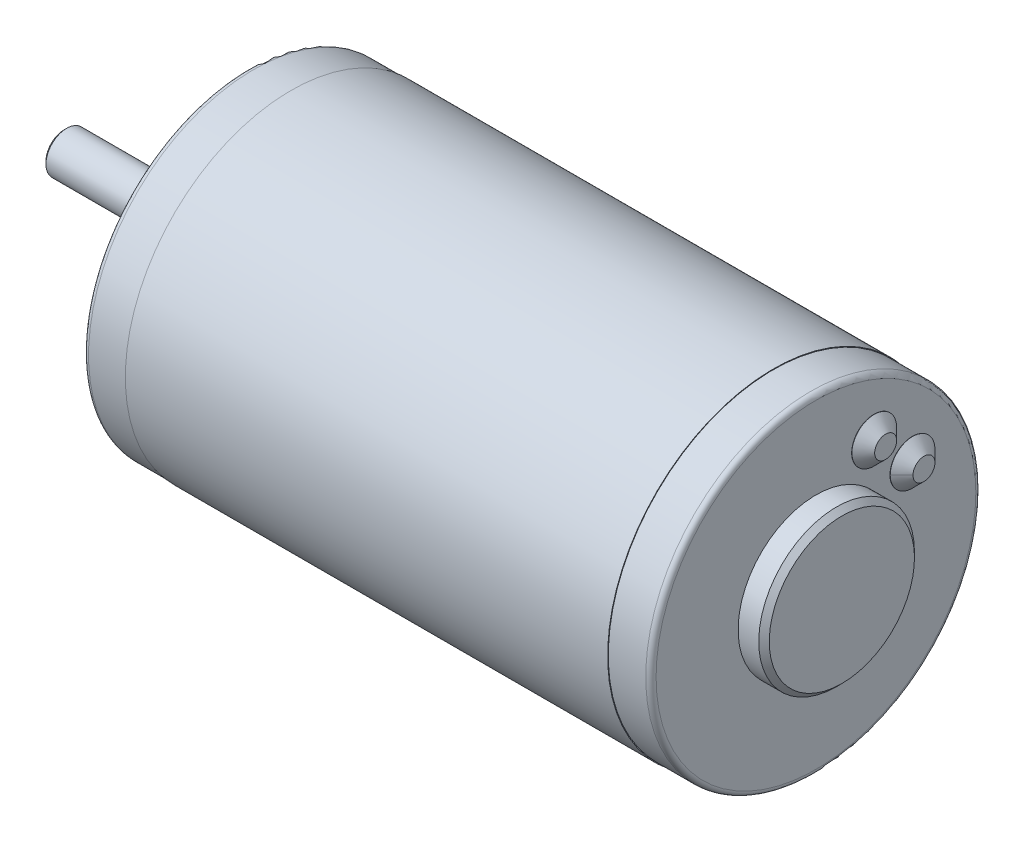
ISO-10303-21;
HEADER;
FILE_DESCRIPTION(('STEP AP214'),'2;1');
FILE_NAME('part.step','',(''),(''),'','','');
FILE_SCHEMA(('AUTOMOTIVE_DESIGN { 1 0 10303 214 1 1 1 1 }'));
ENDSEC;
DATA;
#1=APPLICATION_CONTEXT('core data for automotive mechanical design processes');
#2=APPLICATION_PROTOCOL_DEFINITION('international standard','automotive_design',2000,#1);
#3=PRODUCT_CONTEXT('',#1,'mechanical');
#4=PRODUCT('Part','Part','',(#3));
#5=PRODUCT_RELATED_PRODUCT_CATEGORY('part','',(#4));
#6=PRODUCT_DEFINITION_FORMATION('','',#4);
#7=PRODUCT_DEFINITION_CONTEXT('part definition',#1,'design');
#8=PRODUCT_DEFINITION('design','',#6,#7);
#9=PRODUCT_DEFINITION_SHAPE('','',#8);
#10=(LENGTH_UNIT() NAMED_UNIT(*) SI_UNIT(.MILLI.,.METRE.));
#11=(NAMED_UNIT(*) PLANE_ANGLE_UNIT() SI_UNIT($,.RADIAN.));
#12=(NAMED_UNIT(*) SI_UNIT($,.STERADIAN.) SOLID_ANGLE_UNIT());
#13=UNCERTAINTY_MEASURE_WITH_UNIT(LENGTH_MEASURE(1.E-05),#10,'distance_accuracy_value','');
#14=(GEOMETRIC_REPRESENTATION_CONTEXT(3) GLOBAL_UNCERTAINTY_ASSIGNED_CONTEXT((#13)) GLOBAL_UNIT_ASSIGNED_CONTEXT((#10,
#11,#12)) REPRESENTATION_CONTEXT('',''));
#15=CARTESIAN_POINT('',(0.,0.,0.));
#16=DIRECTION('',(0.,0.,1.));
#17=DIRECTION('',(1.,0.,0.));
#18=AXIS2_PLACEMENT_3D('',#15,#16,#17);
#19=CARTESIAN_POINT('',(-35.6,0.,0.));
#20=DIRECTION('',(-1.,0.,0.));
#21=DIRECTION('',(0.,0.,1.));
#22=AXIS2_PLACEMENT_3D('',#19,#20,#21);
#23=PLANE('',#22);
#24=CARTESIAN_POINT('',(-35.5999999999881,0.,0.));
#25=DIRECTION('',(1.,0.,0.));
#26=DIRECTION('',(0.,0.,-1.));
#27=AXIS2_PLACEMENT_3D('',#24,#25,#26);
#28=CIRCLE('',#27,3.50000000003092);
#29=CARTESIAN_POINT('',(-35.5999999999881,0.,-3.50000000003092));
#30=VERTEX_POINT('',#29);
#31=EDGE_CURVE('E113',#30,#30,#28,.T.);
#32=ORIENTED_EDGE('',*,*,#31,.F.);
#33=EDGE_LOOP('',(#32));
#34=FACE_BOUND('',#33,.T.);
#35=ADVANCED_FACE('F17',(#34),#23,.T.);
#36=CARTESIAN_POINT('',(-27.6,-1.,-2.8));
#37=DIRECTION('',(0.,0.,1.));
#38=DIRECTION('',(1.,0.,0.));
#39=AXIS2_PLACEMENT_3D('',#36,#37,#38);
#40=PLANE('',#39);
#41=CARTESIAN_POINT('',(-7.1,0.,-2.8));
#42=DIRECTION('',(0.,0.,-1.));
#43=DIRECTION('',(-1.,0.,0.));
#44=AXIS2_PLACEMENT_3D('',#41,#42,#43);
#45=CIRCLE('',#44,1.);
#46=CARTESIAN_POINT('',(-7.1,1.,-2.799999999665));
#47=VERTEX_POINT('',#46);
#48=CARTESIAN_POINT('',(-7.1,-1.,-2.799999999665));
#49=VERTEX_POINT('',#48);
#50=EDGE_CURVE('E90',#47,#49,#45,.T.);
#51=ORIENTED_EDGE('',*,*,#50,.T.);
#52=DIRECTION('',(1.,0.,0.));
#53=VECTOR('',#52,1.);
#54=CARTESIAN_POINT('',(-27.6,-1.,-2.79999999933));
#55=LINE('',#54,#53);
#56=CARTESIAN_POINT('',(-26.6,-1.,-2.79999999933));
#57=VERTEX_POINT('',#56);
#58=EDGE_CURVE('E117',#57,#49,#55,.T.);
#59=ORIENTED_EDGE('',*,*,#58,.F.);
#60=CARTESIAN_POINT('',(-26.6,0.,-2.79999999933));
#61=DIRECTION('',(0.,0.,1.));
#62=DIRECTION('',(1.,0.,0.));
#63=AXIS2_PLACEMENT_3D('',#60,#61,#62);
#64=CIRCLE('',#63,1.);
#65=CARTESIAN_POINT('',(-26.6,1.,-2.799999999665));
#66=VERTEX_POINT('',#65);
#67=EDGE_CURVE('E93',#57,#66,#64,.F.);
#68=ORIENTED_EDGE('',*,*,#67,.T.);
#69=DIRECTION('',(1.,0.,0.));
#70=VECTOR('',#69,1.);
#71=CARTESIAN_POINT('',(-27.6,1.,-2.79999999933));
#72=LINE('',#71,#70);
#73=EDGE_CURVE('E87',#66,#47,#72,.T.);
#74=ORIENTED_EDGE('',*,*,#73,.T.);
#75=EDGE_LOOP('',(#51,#59,#68,#74));
#76=FACE_BOUND('',#75,.T.);
#77=ADVANCED_FACE('F89',(#76),#40,.F.);
#78=CARTESIAN_POINT('',(-27.6,1.,-2.8));
#79=DIRECTION('',(0.,1.,0.));
#80=DIRECTION('',(0.,0.,1.));
#81=AXIS2_PLACEMENT_3D('',#78,#79,#80);
#82=PLANE('',#81);
#83=DIRECTION('',(0.,0.,1.));
#84=VECTOR('',#83,1.);
#85=CARTESIAN_POINT('',(-7.1,1.,-2.8));
#86=LINE('',#85,#84);
#87=CARTESIAN_POINT('',(-7.1,0.999999999999687,-3.8729833462075));
#88=VERTEX_POINT('',#87);
#89=EDGE_CURVE('E98',#47,#88,#86,.F.);
#90=ORIENTED_EDGE('',*,*,#89,.F.);
#91=ORIENTED_EDGE('',*,*,#73,.F.);
#92=DIRECTION('',(0.,0.,1.));
#93=VECTOR('',#92,1.);
#94=CARTESIAN_POINT('',(-26.6,1.,-3.87298334621));
#95=LINE('',#94,#93);
#96=CARTESIAN_POINT('',(-26.5999999998,0.999999999999844,-3.8729833462075));
#97=VERTEX_POINT('',#96);
#98=EDGE_CURVE('E111',#66,#97,#95,.F.);
#99=ORIENTED_EDGE('',*,*,#98,.T.);
#100=DIRECTION('',(1.,0.,0.));
#101=VECTOR('',#100,1.);
#102=CARTESIAN_POINT('',(0.,0.999999999999375,-3.87298334620758));
#103=LINE('',#102,#101);
#104=EDGE_CURVE('E110',#88,#97,#103,.F.);
#105=ORIENTED_EDGE('',*,*,#104,.F.);
#106=EDGE_LOOP('',(#90,#91,#99,#105));
#107=FACE_BOUND('',#106,.T.);
#108=ADVANCED_FACE('F108',(#107),#82,.F.);
#109=CARTESIAN_POINT('',(-35.1000000000568,0.,0.));
#110=DIRECTION('',(1.,0.,0.));
#111=DIRECTION('',(0.,0.,-1.));
#112=AXIS2_PLACEMENT_3D('',#109,#110,#111);
#113=CONICAL_SURFACE('',#112,3.99999999996226,0.785398163397448);
#114=ORIENTED_EDGE('',*,*,#31,.T.);
#115=EDGE_LOOP('',(#114));
#116=FACE_BOUND('',#115,.T.);
#117=CARTESIAN_POINT('',(-35.1,0.,0.));
#118=DIRECTION('',(1.,0.,0.));
#119=DIRECTION('',(0.,0.,-1.));
#120=AXIS2_PLACEMENT_3D('',#117,#118,#119);
#121=CIRCLE('',#120,4.);
#122=CARTESIAN_POINT('',(-35.1,0.,-4.));
#123=VERTEX_POINT('',#122);
#124=EDGE_CURVE('E621',#123,#123,#121,.T.);
#125=ORIENTED_EDGE('',*,*,#124,.F.);
#126=EDGE_LOOP('',(#125));
#127=FACE_BOUND('',#126,.T.);
#128=ADVANCED_FACE('F544',(#116,#127),#113,.T.);
#129=CARTESIAN_POINT('',(-26.6,0.,-3.87298334621));
#130=DIRECTION('',(0.,0.,1.));
#131=DIRECTION('',(1.,0.,0.));
#132=AXIS2_PLACEMENT_3D('',#129,#130,#131);
#133=CYLINDRICAL_SURFACE('',#132,1.);
#134=DIRECTION('',(0.,0.,1.));
#135=VECTOR('',#134,1.);
#136=CARTESIAN_POINT('',(-26.6,-1.,-2.8));
#137=LINE('',#136,#135);
#138=CARTESIAN_POINT('',(-26.6,-0.999999999999688,-3.8729833462075));
#139=VERTEX_POINT('',#138);
#140=EDGE_CURVE('E118',#139,#57,#137,.T.);
#141=ORIENTED_EDGE('',*,*,#140,.F.);
#142=CARTESIAN_POINT('',(-26.5999999996,1.,-3.87298334620742));
#143=CARTESIAN_POINT('',(-26.6276629614854,1.00000033684389,-3.87298148578343));
#144=CARTESIAN_POINT('',(-26.6553122162158,0.998851408995708,-3.87328009897941));
#145=CARTESIAN_POINT('',(-26.7104039428575,0.994271305353044,-3.87445904528256));
#146=CARTESIAN_POINT('',(-26.7378464487771,0.990840513576567,-3.8753392805076));
#147=CARTESIAN_POINT('',(-26.8194530829467,0.977175260932386,-3.87881710391479));
#148=CARTESIAN_POINT('',(-26.8730564242201,0.963567703796365,-3.88225202754239));
#149=CARTESIAN_POINT('',(-26.9771255932072,0.927797766818545,-3.89095430300691));
#150=CARTESIAN_POINT('',(-27.0275916625837,0.905636046850779,-3.89622151349687));
#151=CARTESIAN_POINT('',(-27.1241130860774,0.853414285295463,-3.90799157482));
#152=CARTESIAN_POINT('',(-27.170167409718,0.823352404530651,-3.91449471328259));
#153=CARTESIAN_POINT('',(-27.2575394861224,0.755487979522312,-3.92816193939745));
#154=CARTESIAN_POINT('',(-27.2987466449772,0.717545201761585,-3.93533648743472));
#155=CARTESIAN_POINT('',(-27.3742952873619,0.63528422785457,-3.94944965641121));
#156=CARTESIAN_POINT('',(-27.4086343064925,0.590963753060668,-3.95638819192684));
#157=CARTESIAN_POINT('',(-27.4699263911241,0.496434353634745,-3.96936513276029));
#158=CARTESIAN_POINT('',(-27.4967663592451,0.446150035504182,-3.97538918744967));
#159=CARTESIAN_POINT('',(-27.5415435233383,0.341642316787624,-3.98572777187027));
#160=CARTESIAN_POINT('',(-27.5594913900092,0.287423727463188,-3.99004434934737));
#161=CARTESIAN_POINT('',(-27.5817561326448,0.19411173597787,-3.99546891718622));
#162=CARTESIAN_POINT('',(-27.588585793313,0.155632918302861,-3.99715927897636));
#163=CARTESIAN_POINT('',(-27.5977085408051,0.0781080029209764,-3.99942531582434));
#164=CARTESIAN_POINT('',(-27.6000016937716,0.0390619134933367,-4.00000100713419));
#165=CARTESIAN_POINT('',(-27.599997605085,-0.0552317459835864,-3.99999857595865));
#166=CARTESIAN_POINT('',(-27.5954072017814,-0.110495128479081,-3.99884417849431));
#167=CARTESIAN_POINT('',(-27.5771887284743,-0.219452299234612,-3.99434884496972));
#168=CARTESIAN_POINT('',(-27.5635520456882,-0.273144540728357,-3.99100582520555));
#169=CARTESIAN_POINT('',(-27.5277065776784,-0.377348216031181,-3.98250401525139));
#170=CARTESIAN_POINT('',(-27.50550949133,-0.427863881926113,-3.97734770399773));
#171=CARTESIAN_POINT('',(-27.4532106110737,-0.524450982676832,-3.9657685861392));
#172=CARTESIAN_POINT('',(-27.423109018223,-0.570522530531401,-3.9593458117488));
#173=CARTESIAN_POINT('',(-27.3552003629654,-0.657866871057278,-3.94578291730052));
#174=CARTESIAN_POINT('',(-27.3172610821916,-0.699035148909374,-3.93863172676562));
#175=CARTESIAN_POINT('',(-27.2350335448416,-0.774497762760061,-3.92449111086287));
#176=CARTESIAN_POINT('',(-27.19074427933,-0.808791004318425,-3.917501711407));
#177=CARTESIAN_POINT('',(-27.0962571540367,-0.870026617564648,-3.90436326544461));
#178=CARTESIAN_POINT('',(-27.0459800204073,-0.896849892050556,-3.89822853701072));
#179=CARTESIAN_POINT('',(-26.9414633719415,-0.941609493202648,-3.88766043493568));
#180=CARTESIAN_POINT('',(-26.8872268673446,-0.959552492279161,-3.88322578446617));
#181=CARTESIAN_POINT('',(-26.7939162001483,-0.98179305738855,-3.87765011739136));
#182=CARTESIAN_POINT('',(-26.7554596460299,-0.988610024876976,-3.87591131774124));
#183=CARTESIAN_POINT('',(-26.6780089785749,-0.997716332082783,-3.87357302813837));
#184=CARTESIAN_POINT('',(-26.6390152728012,-1.00000893261029,-3.87297271766376));
#185=CARTESIAN_POINT('',(-26.6,-1.,-3.87298334620742));
#186=B_SPLINE_CURVE_WITH_KNOTS('',3,(#142,#143,#144,#145,#146,#147,#148,#149,#150,#151,#152,
#153,#154,#155,#156,#157,#158,#159,#160,#161,#162,#163,#164,#165,#166,#167,#168,#169,#170,#171,
#172,#173,#174,#175,#176,#177,#178,#179,#180,#181,#182,#183,#184,#185),.UNSPECIFIED.,.F.,.F.,(4,
2,2,2,2,2,2,2,2,2,2,2,2,2,2,2,2,2,2,2,2,4),(0.,0.0829364608173561,0.165858967674383,
0.331229962700471,0.496588203442382,0.66198497415249,0.830625162069847,0.999325752680869,
1.17044795786402,1.34136431258294,1.45844938998505,1.57553276026342,1.74108325146555,
1.90679158664071,2.07227425833913,2.23775272126715,2.40629176885183,2.57485762497872,
2.74597444993972,2.91696250618347,3.03398040716278,3.15091393993875),.UNSPECIFIED.);
#187=EDGE_CURVE('E178',#97,#139,#186,.T.);
#188=ORIENTED_EDGE('',*,*,#187,.F.);
#189=ORIENTED_EDGE('',*,*,#98,.F.);
#190=ORIENTED_EDGE('',*,*,#67,.F.);
#191=EDGE_LOOP('',(#141,#188,#189,#190));
#192=FACE_BOUND('',#191,.T.);
#193=ADVANCED_FACE('F536',(#192),#133,.F.);
#194=CARTESIAN_POINT('',(-27.6,-1.,-2.8));
#195=DIRECTION('',(0.,1.,0.));
#196=DIRECTION('',(0.,0.,1.));
#197=AXIS2_PLACEMENT_3D('',#194,#195,#196);
#198=PLANE('',#197);
#199=DIRECTION('',(1.,0.,0.));
#200=VECTOR('',#199,1.);
#201=CARTESIAN_POINT('',(0.,-0.999999999999375,-3.87298334620758));
#202=LINE('',#201,#200);
#203=CARTESIAN_POINT('',(-7.1,-0.999999999999844,-3.8729833462075));
#204=VERTEX_POINT('',#203);
#205=EDGE_CURVE('E177',#139,#204,#202,.T.);
#206=ORIENTED_EDGE('',*,*,#205,.F.);
#207=ORIENTED_EDGE('',*,*,#140,.T.);
#208=ORIENTED_EDGE('',*,*,#58,.T.);
#209=DIRECTION('',(0.,0.,-1.));
#210=VECTOR('',#209,1.);
#211=CARTESIAN_POINT('',(-7.1,-1.,-2.8));
#212=LINE('',#211,#210);
#213=EDGE_CURVE('E106',#49,#204,#212,.T.);
#214=ORIENTED_EDGE('',*,*,#213,.T.);
#215=EDGE_LOOP('',(#206,#207,#208,#214));
#216=FACE_BOUND('',#215,.T.);
#217=ADVANCED_FACE('F529',(#216),#198,.T.);
#218=CARTESIAN_POINT('',(-7.1,0.,-2.8));
#219=DIRECTION('',(0.,0.,-1.));
#220=DIRECTION('',(-1.,0.,0.));
#221=AXIS2_PLACEMENT_3D('',#218,#219,#220);
#222=CYLINDRICAL_SURFACE('',#221,1.);
#223=ORIENTED_EDGE('',*,*,#213,.F.);
#224=ORIENTED_EDGE('',*,*,#50,.F.);
#225=ORIENTED_EDGE('',*,*,#89,.T.);
#226=CARTESIAN_POINT('',(-7.1,-1.0000000001221,-3.872983346302));
#227=CARTESIAN_POINT('',(-7.07233703811739,-1.00000033687793,-3.87298148582111));
#228=CARTESIAN_POINT('',(-7.04468778338877,-0.998851408986146,-3.8732800989946));
#229=CARTESIAN_POINT('',(-6.98959605674884,-0.994271305296994,-3.87445904528425));
#230=CARTESIAN_POINT('',(-6.96215355082925,-0.990840513517515,-3.87533928051829));
#231=CARTESIAN_POINT('',(-6.88054691665886,-0.977175260852706,-3.87881710394372));
#232=CARTESIAN_POINT('',(-6.82694357538663,-0.963567703687489,-3.88225202757187));
#233=CARTESIAN_POINT('',(-6.72287440640773,-0.927797766659824,-3.89095430304254));
#234=CARTESIAN_POINT('',(-6.67240833703816,-0.905636046671756,-3.89622151353801));
#235=CARTESIAN_POINT('',(-6.57588691356292,-0.853414285075293,-3.90799157486883));
#236=CARTESIAN_POINT('',(-6.52983258993375,-0.823352404289781,-3.91449471333359));
#237=CARTESIAN_POINT('',(-6.44246051355568,-0.755487979242093,-3.92816193945135));
#238=CARTESIAN_POINT('',(-6.40125335471588,-0.717545201462774,-3.93533648748934));
#239=CARTESIAN_POINT('',(-6.32570471236362,-0.63528422752032,-3.94944965646521));
#240=CARTESIAN_POINT('',(-6.29136569325069,-0.590963752709505,-3.95638819197949));
#241=CARTESIAN_POINT('',(-6.23007360865886,-0.496434353254452,-3.969365132808));
#242=CARTESIAN_POINT('',(-6.20323364055975,-0.446150035111945,-3.97538918749381));
#243=CARTESIAN_POINT('',(-6.15845647651223,-0.341642316375673,-3.9857277719057));
#244=CARTESIAN_POINT('',(-6.14050860986507,-0.287423727043496,-3.99004434937767));
#245=CARTESIAN_POINT('',(-6.11824386728725,-0.194111735619457,-3.995468917203));
#246=CARTESIAN_POINT('',(-6.11141420664443,-0.155632918014258,-3.9971592789869));
#247=CARTESIAN_POINT('',(-6.10229145918635,-0.07810800277512,-3.9994253158265));
#248=CARTESIAN_POINT('',(-6.09999830622838,-0.0390619134204156,-4.00000100713419));
#249=CARTESIAN_POINT('',(-6.10000239491503,0.0552317459833975,-3.99999857595865));
#250=CARTESIAN_POINT('',(-6.10459279821858,0.110495128478849,-3.99884417849432));
#251=CARTESIAN_POINT('',(-6.12281127152564,0.21945229923443,-3.99434884496973));
#252=CARTESIAN_POINT('',(-6.13644795431172,0.273144540728263,-3.99100582520556));
#253=CARTESIAN_POINT('',(-6.17229342232156,0.377348216031197,-3.98250401525139));
#254=CARTESIAN_POINT('',(-6.19449050867004,0.427863881926156,-3.97734770399773));
#255=CARTESIAN_POINT('',(-6.24678938892637,0.524450982676873,-3.96576858613919));
#256=CARTESIAN_POINT('',(-6.27689098177704,0.570522530531419,-3.9593458117488));
#257=CARTESIAN_POINT('',(-6.34479963703463,0.657866871057261,-3.94578291730052));
#258=CARTESIAN_POINT('',(-6.38273891780834,0.699035148909346,-3.93863172676563));
#259=CARTESIAN_POINT('',(-6.46496645515835,0.774497762760038,-3.92449111086287));
#260=CARTESIAN_POINT('',(-6.50925572067001,0.808791004318414,-3.917501711407));
#261=CARTESIAN_POINT('',(-6.60374284596335,0.870026617564677,-3.9043632654446));
#262=CARTESIAN_POINT('',(-6.65401997959275,0.896849892050607,-3.89822853701071));
#263=CARTESIAN_POINT('',(-6.75853662805867,0.941609493202684,-3.88766043493567));
#264=CARTESIAN_POINT('',(-6.81277313265555,0.959552492279176,-3.88322578446618));
#265=CARTESIAN_POINT('',(-6.90608379980686,0.981793057377871,-3.87765011739403));
#266=CARTESIAN_POINT('',(-6.94454035387909,0.98861002486086,-3.87591131774534));
#267=CARTESIAN_POINT('',(-7.02199102124091,0.997716332066555,-3.87357302814256));
#268=CARTESIAN_POINT('',(-7.06098472696764,1.0000089325994,-3.87297271766662));
#269=CARTESIAN_POINT('',(-7.0999999997225,1.,-3.87298334620742));
#270=B_SPLINE_CURVE_WITH_KNOTS('',3,(#226,#227,#228,#229,#230,#231,#232,#233,#234,#235,#236,
#237,#238,#239,#240,#241,#242,#243,#244,#245,#246,#247,#248,#249,#250,#251,#252,#253,#254,#255,
#256,#257,#258,#259,#260,#261,#262,#263,#264,#265,#266,#267,#268,#269),.UNSPECIFIED.,.F.,.F.,(4,
2,2,2,2,2,2,2,2,2,2,2,2,2,2,2,2,2,2,2,2,4),(0.,0.0829364608167722,0.16585896767728,
0.331229962718466,0.496588203468748,0.661984974184169,0.830625162106715,0.999325752724678,
1.17044795790744,1.3413643126246,1.45844938980816,1.57553275986813,1.74108325106995,
1.90679158624542,2.07227425794391,2.23775272087186,2.40629176845648,2.57485762458343,
2.7459744495446,2.91696250578819,3.03398040662922,3.15091393926647),.UNSPECIFIED.);
#271=EDGE_CURVE('E170',#204,#88,#270,.T.);
#272=ORIENTED_EDGE('',*,*,#271,.F.);
#273=EDGE_LOOP('',(#223,#224,#225,#272));
#274=FACE_BOUND('',#273,.T.);
#275=ADVANCED_FACE('F103',(#274),#222,.F.);
#276=CARTESIAN_POINT('',(0.,0.,0.));
#277=DIRECTION('',(1.,0.,0.));
#278=DIRECTION('',(0.,0.,-1.));
#279=AXIS2_PLACEMENT_3D('',#276,#277,#278);
#280=CYLINDRICAL_SURFACE('',#279,4.);
#281=ORIENTED_EDGE('',*,*,#124,.T.);
#282=EDGE_LOOP('',(#281));
#283=FACE_BOUND('',#282,.T.);
#284=ORIENTED_EDGE('',*,*,#104,.T.);
#285=ORIENTED_EDGE('',*,*,#187,.T.);
#286=ORIENTED_EDGE('',*,*,#205,.T.);
#287=ORIENTED_EDGE('',*,*,#271,.T.);
#288=EDGE_LOOP('',(#284,#285,#286,#287));
#289=FACE_BOUND('',#288,.T.);
#290=CARTESIAN_POINT('',(-4.,0.,0.));
#291=DIRECTION('',(1.,0.,0.));
#292=DIRECTION('',(0.,0.,-1.));
#293=AXIS2_PLACEMENT_3D('',#290,#291,#292);
#294=CIRCLE('',#293,4.);
#295=CARTESIAN_POINT('',(-4.,0.,-4.));
#296=VERTEX_POINT('',#295);
#297=EDGE_CURVE('E167',#296,#296,#294,.T.);
#298=ORIENTED_EDGE('',*,*,#297,.F.);
#299=EDGE_LOOP('',(#298));
#300=FACE_BOUND('',#299,.T.);
#301=ADVANCED_FACE('F186',(#283,#289,#300),#280,.T.);
#302=CARTESIAN_POINT('',(-4.,4.,0.));
#303=DIRECTION('',(-1.,0.,0.));
#304=DIRECTION('',(0.,0.,1.));
#305=AXIS2_PLACEMENT_3D('',#302,#303,#304);
#306=PLANE('',#305);
#307=ORIENTED_EDGE('',*,*,#297,.T.);
#308=EDGE_LOOP('',(#307));
#309=FACE_BOUND('',#308,.T.);
#310=CARTESIAN_POINT('',(-4.00000000000046,0.,0.));
#311=DIRECTION('',(1.,0.,0.));
#312=DIRECTION('',(0.,1.,0.));
#313=AXIS2_PLACEMENT_3D('',#310,#311,#312);
#314=CIRCLE('',#313,8.50900000000046);
#315=CARTESIAN_POINT('',(-4.00000000000046,8.50900000000046,0.));
#316=VERTEX_POINT('',#315);
#317=EDGE_CURVE('E164',#316,#316,#314,.T.);
#318=ORIENTED_EDGE('',*,*,#317,.F.);
#319=EDGE_LOOP('',(#318));
#320=FACE_BOUND('',#319,.T.);
#321=ADVANCED_FACE('F190',(#309,#320),#306,.T.);
#322=CARTESIAN_POINT('',(111.8479,11.2073596391,-18.6070906829));
#323=DIRECTION('',(1.,0.,0.));
#324=DIRECTION('',(0.,0.,-1.));
#325=AXIS2_PLACEMENT_3D('',#322,#323,#324);
#326=PLANE('',#325);
#327=CARTESIAN_POINT('',(111.847899999987,11.2073596391,-18.6070906829));
#328=DIRECTION('',(-1.,0.,0.));
#329=DIRECTION('',(0.,-1.,0.));
#330=AXIS2_PLACEMENT_3D('',#327,#328,#329);
#331=CIRCLE('',#330,2.11800000000174);
#332=CARTESIAN_POINT('',(111.847899999987,11.2073596391,-20.7250906828988));
#333=VERTEX_POINT('',#332);
#334=CARTESIAN_POINT('',(111.847899999987,11.2073596391,-16.4890906829071));
#335=VERTEX_POINT('',#334);
#336=EDGE_CURVE('E161',#333,#335,#331,.T.);
#337=ORIENTED_EDGE('',*,*,#336,.F.);
#338=CARTESIAN_POINT('',(111.847899999987,11.2073596391,-18.6070906829));
#339=DIRECTION('',(-1.,0.,0.));
#340=DIRECTION('',(0.,0.,1.));
#341=AXIS2_PLACEMENT_3D('',#338,#339,#340);
#342=CIRCLE('',#341,2.11799999998995);
#343=EDGE_CURVE('E157',#335,#333,#342,.T.);
#344=ORIENTED_EDGE('',*,*,#343,.F.);
#345=EDGE_LOOP('',(#337,#344));
#346=FACE_BOUND('',#345,.T.);
#347=ADVANCED_FACE('F195',(#346),#326,.T.);
#348=CARTESIAN_POINT('',(111.8479,18.6070906829,-11.2073596391));
#349=DIRECTION('',(1.,0.,0.));
#350=DIRECTION('',(0.,0.,-1.));
#351=AXIS2_PLACEMENT_3D('',#348,#349,#350);
#352=PLANE('',#351);
#353=CARTESIAN_POINT('',(111.847899999987,18.6070906829,-11.2073596391));
#354=DIRECTION('',(-1.,0.,0.));
#355=DIRECTION('',(0.,0.,1.));
#356=AXIS2_PLACEMENT_3D('',#353,#354,#355);
#357=CIRCLE('',#356,2.11799999998028);
#358=CARTESIAN_POINT('',(111.847899999987,18.6070906829,-9.08935963911972));
#359=VERTEX_POINT('',#358);
#360=EDGE_CURVE('E153',#359,#359,#357,.T.);
#361=ORIENTED_EDGE('',*,*,#360,.F.);
#362=EDGE_LOOP('',(#361));
#363=FACE_BOUND('',#362,.T.);
#364=ADVANCED_FACE('F199',(#363),#352,.T.);
#365=CARTESIAN_POINT('',(114.6,15.0368,0.));
#366=DIRECTION('',(1.,0.,0.));
#367=DIRECTION('',(0.,0.,-1.));
#368=AXIS2_PLACEMENT_3D('',#365,#366,#367);
#369=PLANE('',#368);
#370=CARTESIAN_POINT('',(114.6,0.,0.));
#371=DIRECTION('',(-1.,0.,0.));
#372=DIRECTION('',(0.,-1.,0.));
#373=AXIS2_PLACEMENT_3D('',#370,#371,#372);
#374=CIRCLE('',#373,14.0208);
#375=CARTESIAN_POINT('',(114.6,-14.0208,0.));
#376=VERTEX_POINT('',#375);
#377=EDGE_CURVE('E149',#376,#376,#374,.T.);
#378=ORIENTED_EDGE('',*,*,#377,.F.);
#379=EDGE_LOOP('',(#378));
#380=FACE_BOUND('',#379,.T.);
#381=ADVANCED_FACE('F203',(#380),#369,.T.);
#382=CARTESIAN_POINT('',(13.6144000000513,25.4,0.));
#383=DIRECTION('',(-1.,0.,0.));
#384=DIRECTION('',(0.,-1.,0.));
#385=AXIS2_PLACEMENT_3D('',#382,#383,#384);
#386=CONICAL_SURFACE('',#385,2.01929999980166,1.02974425850634);
#387=CARTESIAN_POINT('',(14.8277178480214,25.4,-2.55795384873636E-10));
#388=VERTEX_POINT('',#387);
#389=VERTEX_LOOP('',#388);
#390=FACE_BOUND('',#389,.T.);
#391=CARTESIAN_POINT('',(13.6144,25.4,0.));
#392=DIRECTION('',(-1.,0.,0.));
#393=DIRECTION('',(0.,0.,1.));
#394=AXIS2_PLACEMENT_3D('',#391,#392,#393);
#395=CIRCLE('',#394,2.0193);
#396=CARTESIAN_POINT('',(13.6144,25.4,2.0193));
#397=VERTEX_POINT('',#396);
#398=EDGE_CURVE('E152',#397,#397,#395,.T.);
#399=ORIENTED_EDGE('',*,*,#398,.T.);
#400=EDGE_LOOP('',(#399));
#401=FACE_BOUND('',#400,.T.);
#402=ADVANCED_FACE('F207',(#390,#401),#386,.F.);
#403=CARTESIAN_POINT('',(13.6144000000513,-25.4,0.));
#404=DIRECTION('',(-1.,0.,0.));
#405=DIRECTION('',(0.,-1.,0.));
#406=AXIS2_PLACEMENT_3D('',#403,#404,#405);
#407=CONICAL_SURFACE('',#406,2.01929999980166,1.02974425850634);
#408=CARTESIAN_POINT('',(14.8277178480214,-25.4,-2.55795384873636E-10));
#409=VERTEX_POINT('',#408);
#410=VERTEX_LOOP('',#409);
#411=FACE_BOUND('',#410,.T.);
#412=CARTESIAN_POINT('',(13.6144,-25.4,0.));
#413=DIRECTION('',(-1.,0.,0.));
#414=DIRECTION('',(0.,0.,1.));
#415=AXIS2_PLACEMENT_3D('',#412,#413,#414);
#416=CIRCLE('',#415,2.0193);
#417=CARTESIAN_POINT('',(13.6144,-25.4,2.0193));
#418=VERTEX_POINT('',#417);
#419=EDGE_CURVE('E632',#418,#418,#416,.T.);
#420=ORIENTED_EDGE('',*,*,#419,.T.);
#421=EDGE_LOOP('',(#420));
#422=FACE_BOUND('',#421,.T.);
#423=ADVANCED_FACE('F211',(#411,#422),#407,.F.);
#424=CARTESIAN_POINT('',(-2.984,0.,0.));
#425=DIRECTION('',(1.,0.,0.));
#426=DIRECTION('',(0.,1.,0.));
#427=AXIS2_PLACEMENT_3D('',#424,#425,#426);
#428=CONICAL_SURFACE('',#427,9.525,0.785398163397);
#429=ORIENTED_EDGE('',*,*,#317,.T.);
#430=EDGE_LOOP('',(#429));
#431=FACE_BOUND('',#430,.T.);
#432=CARTESIAN_POINT('',(-2.984,0.,0.));
#433=DIRECTION('',(1.,0.,0.));
#434=DIRECTION('',(0.,0.,-1.));
#435=AXIS2_PLACEMENT_3D('',#432,#433,#434);
#436=CIRCLE('',#435,9.525);
#437=CARTESIAN_POINT('',(-2.984,0.,-9.525));
#438=VERTEX_POINT('',#437);
#439=EDGE_CURVE('E635',#438,#438,#436,.T.);
#440=ORIENTED_EDGE('',*,*,#439,.F.);
#441=EDGE_LOOP('',(#440));
#442=FACE_BOUND('',#441,.T.);
#443=ADVANCED_FACE('F215',(#431,#442),#428,.T.);
#444=CARTESIAN_POINT('',(109.647900000027,11.2073596391,-18.6070906829));
#445=DIRECTION('',(-1.,0.,0.));
#446=DIRECTION('',(0.,-1.,0.));
#447=AXIS2_PLACEMENT_3D('',#444,#445,#446);
#448=CONICAL_SURFACE('',#447,4.31799999990424,0.785398163384529);
#449=DIRECTION('',(0.707106781186864,0.,-0.707106781186231));
#450=VECTOR('',#449,1.);
#451=CARTESIAN_POINT('',(-498904.641191129,11.2073596391,499000.));
#452=LINE('',#451,#450);
#453=CARTESIAN_POINT('',(109.647900000021,11.2073596391,-14.2890906829269));
#454=VERTEX_POINT('',#453);
#455=EDGE_CURVE('E156',#454,#335,#452,.T.);
#456=ORIENTED_EDGE('',*,*,#455,.F.);
#457=CARTESIAN_POINT('',(109.6479,11.2073596391,-18.6070906829));
#458=DIRECTION('',(-1.,0.,0.));
#459=DIRECTION('',(0.,0.,1.));
#460=AXIS2_PLACEMENT_3D('',#457,#458,#459);
#461=CIRCLE('',#460,4.318);
#462=CARTESIAN_POINT('',(109.647900000021,11.2073596391,-22.9250906828761));
#463=VERTEX_POINT('',#462);
#464=EDGE_CURVE('E638',#463,#454,#461,.T.);
#465=ORIENTED_EDGE('',*,*,#464,.F.);
#466=DIRECTION('',(0.707106781186864,0.,0.707106781186231));
#467=VECTOR('',#466,1.);
#468=CARTESIAN_POINT('',(-498904.641191129,11.2073596391611,-499037.214181366));
#469=LINE('',#468,#467);
#470=EDGE_CURVE('E160',#333,#463,#469,.F.);
#471=ORIENTED_EDGE('',*,*,#470,.F.);
#472=ORIENTED_EDGE('',*,*,#336,.T.);
#473=EDGE_LOOP('',(#456,#465,#471,#472));
#474=FACE_BOUND('',#473,.T.);
#475=ADVANCED_FACE('F219',(#474),#448,.T.);
#476=CARTESIAN_POINT('',(109.647900000084,11.2073596391,-18.6070906829));
#477=DIRECTION('',(-1.,0.,0.));
#478=DIRECTION('',(0.,0.,1.));
#479=AXIS2_PLACEMENT_3D('',#476,#477,#478);
#480=CONICAL_SURFACE('',#479,4.31799999989246,0.785398163397448);
#481=CARTESIAN_POINT('',(109.6479,11.2073596391,-18.6070906829));
#482=DIRECTION('',(-1.,0.,0.));
#483=DIRECTION('',(0.,0.,1.));
#484=AXIS2_PLACEMENT_3D('',#481,#482,#483);
#485=CIRCLE('',#484,4.318);
#486=EDGE_CURVE('E649',#454,#463,#485,.T.);
#487=ORIENTED_EDGE('',*,*,#486,.F.);
#488=ORIENTED_EDGE('',*,*,#455,.T.);
#489=ORIENTED_EDGE('',*,*,#343,.T.);
#490=ORIENTED_EDGE('',*,*,#470,.T.);
#491=EDGE_LOOP('',(#487,#488,#489,#490));
#492=FACE_BOUND('',#491,.T.);
#493=ADVANCED_FACE('F223',(#492),#480,.T.);
#494=CARTESIAN_POINT('',(109.64789999997,18.6070906829,-11.2073596391));
#495=DIRECTION('',(-1.,0.,0.));
#496=DIRECTION('',(0.,0.,1.));
#497=AXIS2_PLACEMENT_3D('',#494,#495,#496);
#498=CONICAL_SURFACE('',#497,4.31799999999647,0.785398163397448);
#499=CARTESIAN_POINT('',(109.6479,18.6070906829,-11.2073596391));
#500=DIRECTION('',(-1.,0.,0.));
#501=DIRECTION('',(0.,0.,1.));
#502=AXIS2_PLACEMENT_3D('',#499,#500,#501);
#503=CIRCLE('',#502,4.318);
#504=CARTESIAN_POINT('',(109.6479,18.6070906829,-6.8893596391));
#505=VERTEX_POINT('',#504);
#506=EDGE_CURVE('E652',#505,#505,#503,.T.);
#507=ORIENTED_EDGE('',*,*,#506,.F.);
#508=EDGE_LOOP('',(#507));
#509=FACE_BOUND('',#508,.T.);
#510=ORIENTED_EDGE('',*,*,#360,.T.);
#511=EDGE_LOOP('',(#510));
#512=FACE_BOUND('',#511,.T.);
#513=ADVANCED_FACE('F227',(#509,#512),#498,.T.);
#514=CARTESIAN_POINT('',(113.584,0.,0.));
#515=DIRECTION('',(-1.,0.,0.));
#516=DIRECTION('',(0.,-1.,0.));
#517=AXIS2_PLACEMENT_3D('',#514,#515,#516);
#518=CONICAL_SURFACE('',#517,15.0367999999995,0.785398163396999);
#519=ORIENTED_EDGE('',*,*,#377,.T.);
#520=EDGE_LOOP('',(#519));
#521=FACE_BOUND('',#520,.T.);
#522=CARTESIAN_POINT('',(113.584,0.,0.));
#523=DIRECTION('',(1.,0.,0.));
#524=DIRECTION('',(0.,0.,-1.));
#525=AXIS2_PLACEMENT_3D('',#522,#523,#524);
#526=CIRCLE('',#525,15.0368);
#527=CARTESIAN_POINT('',(113.584,0.,-15.0368));
#528=VERTEX_POINT('',#527);
#529=EDGE_CURVE('E148',#528,#528,#526,.F.);
#530=ORIENTED_EDGE('',*,*,#529,.F.);
#531=EDGE_LOOP('',(#530));
#532=FACE_BOUND('',#531,.T.);
#533=ADVANCED_FACE('F231',(#521,#532),#518,.T.);
#534=CARTESIAN_POINT('',(0.,25.4,0.));
#535=DIRECTION('',(-1.,0.,0.));
#536=DIRECTION('',(0.,0.,1.));
#537=AXIS2_PLACEMENT_3D('',#534,#535,#536);
#538=CYLINDRICAL_SURFACE('',#537,2.0193);
#539=CARTESIAN_POINT('',(0.,25.4,0.));
#540=DIRECTION('',(-1.,0.,0.));
#541=DIRECTION('',(0.,0.,1.));
#542=AXIS2_PLACEMENT_3D('',#539,#540,#541);
#543=CIRCLE('',#542,2.0193);
#544=CARTESIAN_POINT('',(0.,25.4,2.0193));
#545=VERTEX_POINT('',#544);
#546=EDGE_CURVE('E145',#545,#545,#543,.F.);
#547=ORIENTED_EDGE('',*,*,#546,.F.);
#548=EDGE_LOOP('',(#547));
#549=FACE_BOUND('',#548,.T.);
#550=ORIENTED_EDGE('',*,*,#398,.F.);
#551=EDGE_LOOP('',(#550));
#552=FACE_BOUND('',#551,.T.);
#553=ADVANCED_FACE('F235',(#549,#552),#538,.F.);
#554=CARTESIAN_POINT('',(0.,-25.4,0.));
#555=DIRECTION('',(-1.,0.,0.));
#556=DIRECTION('',(0.,0.,1.));
#557=AXIS2_PLACEMENT_3D('',#554,#555,#556);
#558=CYLINDRICAL_SURFACE('',#557,2.0193);
#559=CARTESIAN_POINT('',(0.,-25.4,0.));
#560=DIRECTION('',(-1.,0.,0.));
#561=DIRECTION('',(0.,0.,1.));
#562=AXIS2_PLACEMENT_3D('',#559,#560,#561);
#563=CIRCLE('',#562,2.0193);
#564=CARTESIAN_POINT('',(0.,-25.4,2.0193));
#565=VERTEX_POINT('',#564);
#566=EDGE_CURVE('E142',#565,#565,#563,.F.);
#567=ORIENTED_EDGE('',*,*,#566,.F.);
#568=EDGE_LOOP('',(#567));
#569=FACE_BOUND('',#568,.T.);
#570=ORIENTED_EDGE('',*,*,#419,.F.);
#571=EDGE_LOOP('',(#570));
#572=FACE_BOUND('',#571,.T.);
#573=ADVANCED_FACE('F239',(#569,#572),#558,.F.);
#574=CARTESIAN_POINT('',(0.,0.,0.));
#575=DIRECTION('',(1.,0.,0.));
#576=DIRECTION('',(0.,0.,-1.));
#577=AXIS2_PLACEMENT_3D('',#574,#575,#576);
#578=CYLINDRICAL_SURFACE('',#577,9.525);
#579=ORIENTED_EDGE('',*,*,#439,.T.);
#580=EDGE_LOOP('',(#579));
#581=FACE_BOUND('',#580,.T.);
#582=CARTESIAN_POINT('',(0.,0.,0.));
#583=DIRECTION('',(1.,0.,0.));
#584=DIRECTION('',(0.,0.,-1.));
#585=AXIS2_PLACEMENT_3D('',#582,#583,#584);
#586=CIRCLE('',#585,9.525);
#587=CARTESIAN_POINT('',(0.,0.,-9.525));
#588=VERTEX_POINT('',#587);
#589=EDGE_CURVE('E139',#588,#588,#586,.T.);
#590=ORIENTED_EDGE('',*,*,#589,.F.);
#591=EDGE_LOOP('',(#590));
#592=FACE_BOUND('',#591,.T.);
#593=ADVANCED_FACE('F243',(#581,#592),#578,.T.);
#594=CARTESIAN_POINT('',(111.8479,11.2073596391,-18.6070906829));
#595=DIRECTION('',(-1.,0.,0.));
#596=DIRECTION('',(0.,0.,1.));
#597=AXIS2_PLACEMENT_3D('',#594,#595,#596);
#598=CYLINDRICAL_SURFACE('',#597,4.318);
#599=CARTESIAN_POINT('',(109.6,11.2073596391,-18.6070906829));
#600=DIRECTION('',(-1.,0.,0.));
#601=DIRECTION('',(0.,0.,1.));
#602=AXIS2_PLACEMENT_3D('',#599,#600,#601);
#603=CIRCLE('',#602,4.318);
#604=CARTESIAN_POINT('',(109.6,11.2073596391,-14.2890906829));
#605=VERTEX_POINT('',#604);
#606=EDGE_CURVE('E136',#605,#605,#603,.T.);
#607=ORIENTED_EDGE('',*,*,#606,.F.);
#608=EDGE_LOOP('',(#607));
#609=FACE_BOUND('',#608,.T.);
#610=ORIENTED_EDGE('',*,*,#486,.T.);
#611=ORIENTED_EDGE('',*,*,#464,.T.);
#612=EDGE_LOOP('',(#610,#611));
#613=FACE_BOUND('',#612,.T.);
#614=ADVANCED_FACE('F247',(#609,#613),#598,.T.);
#615=CARTESIAN_POINT('',(111.8479,18.6070906829,-11.2073596391));
#616=DIRECTION('',(-1.,0.,0.));
#617=DIRECTION('',(0.,0.,1.));
#618=AXIS2_PLACEMENT_3D('',#615,#616,#617);
#619=CYLINDRICAL_SURFACE('',#618,4.318);
#620=CARTESIAN_POINT('',(109.6,18.6070906829,-11.2073596391));
#621=DIRECTION('',(-1.,0.,0.));
#622=DIRECTION('',(0.,0.,1.));
#623=AXIS2_PLACEMENT_3D('',#620,#621,#622);
#624=CIRCLE('',#623,4.318);
#625=CARTESIAN_POINT('',(109.6,18.6070906829,-6.8893596391));
#626=VERTEX_POINT('',#625);
#627=EDGE_CURVE('E133',#626,#626,#624,.T.);
#628=ORIENTED_EDGE('',*,*,#627,.F.);
#629=EDGE_LOOP('',(#628));
#630=FACE_BOUND('',#629,.T.);
#631=ORIENTED_EDGE('',*,*,#506,.T.);
#632=EDGE_LOOP('',(#631));
#633=FACE_BOUND('',#632,.T.);
#634=ADVANCED_FACE('F251',(#630,#633),#619,.T.);
#635=CARTESIAN_POINT('',(0.,0.,0.));
#636=DIRECTION('',(1.,0.,0.));
#637=DIRECTION('',(0.,0.,-1.));
#638=AXIS2_PLACEMENT_3D('',#635,#636,#637);
#639=CYLINDRICAL_SURFACE('',#638,15.0368);
#640=CARTESIAN_POINT('',(109.6,0.,0.));
#641=DIRECTION('',(1.,0.,0.));
#642=DIRECTION('',(0.,0.,-1.));
#643=AXIS2_PLACEMENT_3D('',#640,#641,#642);
#644=CIRCLE('',#643,15.0368);
#645=CARTESIAN_POINT('',(109.6,0.,-15.0368));
#646=VERTEX_POINT('',#645);
#647=EDGE_CURVE('E129',#646,#646,#644,.F.);
#648=ORIENTED_EDGE('',*,*,#647,.F.);
#649=EDGE_LOOP('',(#648));
#650=FACE_BOUND('',#649,.T.);
#651=ORIENTED_EDGE('',*,*,#529,.T.);
#652=EDGE_LOOP('',(#651));
#653=FACE_BOUND('',#652,.T.);
#654=ADVANCED_FACE('F255',(#650,#653),#639,.T.);
#655=CARTESIAN_POINT('',(0.,9.525,0.));
#656=DIRECTION('',(-1.,0.,0.));
#657=DIRECTION('',(0.,0.,1.));
#658=AXIS2_PLACEMENT_3D('',#655,#656,#657);
#659=PLANE('',#658);
#660=ORIENTED_EDGE('',*,*,#589,.T.);
#661=EDGE_LOOP('',(#660));
#662=FACE_BOUND('',#661,.T.);
#663=ORIENTED_EDGE('',*,*,#566,.T.);
#664=EDGE_LOOP('',(#663));
#665=FACE_BOUND('',#664,.T.);
#666=ORIENTED_EDGE('',*,*,#546,.T.);
#667=EDGE_LOOP('',(#666));
#668=FACE_BOUND('',#667,.T.);
#669=CARTESIAN_POINT('',(0.,0.,0.));
#670=DIRECTION('',(1.,0.,0.));
#671=DIRECTION('',(0.,0.,-1.));
#672=AXIS2_PLACEMENT_3D('',#669,#670,#671);
#673=CIRCLE('',#672,30.877);
#674=CARTESIAN_POINT('',(0.,0.,-30.877));
#675=VERTEX_POINT('',#674);
#676=CARTESIAN_POINT('',(0.,0.,30.877));
#677=VERTEX_POINT('',#676);
#678=EDGE_CURVE('E132',#675,#677,#673,.T.);
#679=ORIENTED_EDGE('',*,*,#678,.F.);
#680=CARTESIAN_POINT('',(0.,0.,0.));
#681=DIRECTION('',(1.,0.,0.));
#682=DIRECTION('',(0.,0.,1.));
#683=AXIS2_PLACEMENT_3D('',#680,#681,#682);
#684=CIRCLE('',#683,30.877);
#685=EDGE_CURVE('E286',#677,#675,#684,.T.);
#686=ORIENTED_EDGE('',*,*,#685,.F.);
#687=EDGE_LOOP('',(#679,#686));
#688=FACE_BOUND('',#687,.T.);
#689=ADVANCED_FACE('F259',(#662,#665,#668,#688),#659,.T.);
#690=CARTESIAN_POINT('',(109.6,31.877,0.));
#691=DIRECTION('',(1.,0.,0.));
#692=DIRECTION('',(0.,0.,-1.));
#693=AXIS2_PLACEMENT_3D('',#690,#691,#692);
#694=PLANE('',#693);
#695=ORIENTED_EDGE('',*,*,#647,.T.);
#696=EDGE_LOOP('',(#695));
#697=FACE_BOUND('',#696,.T.);
#698=ORIENTED_EDGE('',*,*,#627,.T.);
#699=EDGE_LOOP('',(#698));
#700=FACE_BOUND('',#699,.T.);
#701=ORIENTED_EDGE('',*,*,#606,.T.);
#702=EDGE_LOOP('',(#701));
#703=FACE_BOUND('',#702,.T.);
#704=CARTESIAN_POINT('',(109.6,0.,0.));
#705=DIRECTION('',(-1.,0.,0.));
#706=DIRECTION('',(0.,0.,1.));
#707=AXIS2_PLACEMENT_3D('',#704,#705,#706);
#708=CIRCLE('',#707,30.877);
#709=CARTESIAN_POINT('',(109.6,0.,30.877));
#710=VERTEX_POINT('',#709);
#711=CARTESIAN_POINT('',(109.6,0.,-30.877));
#712=VERTEX_POINT('',#711);
#713=EDGE_CURVE('E36',#710,#712,#708,.T.);
#714=ORIENTED_EDGE('',*,*,#713,.F.);
#715=CARTESIAN_POINT('',(109.6,0.,0.));
#716=DIRECTION('',(-1.,0.,0.));
#717=DIRECTION('',(0.,0.,-1.));
#718=AXIS2_PLACEMENT_3D('',#715,#716,#717);
#719=CIRCLE('',#718,30.877);
#720=EDGE_CURVE('E323',#712,#710,#719,.T.);
#721=ORIENTED_EDGE('',*,*,#720,.F.);
#722=EDGE_LOOP('',(#714,#721));
#723=FACE_BOUND('',#722,.T.);
#724=ADVANCED_FACE('F264',(#697,#700,#703,#723),#694,.T.);
#725=CARTESIAN_POINT('',(1.,0.,0.));
#726=DIRECTION('',(-1.,0.,0.));
#727=DIRECTION('',(0.,0.,-1.));
#728=AXIS2_PLACEMENT_3D('',#725,#726,#727);
#729=TOROIDAL_SURFACE('',#728,30.877,1.);
#730=CARTESIAN_POINT('',(1.,0.,0.));
#731=DIRECTION('',(1.,0.,0.));
#732=DIRECTION('',(0.,0.,-1.));
#733=AXIS2_PLACEMENT_3D('',#730,#731,#732);
#734=CIRCLE('',#733,31.877);
#735=CARTESIAN_POINT('',(1.,0.,-31.877));
#736=VERTEX_POINT('',#735);
#737=EDGE_CURVE('E310',#736,#736,#734,.T.);
#738=ORIENTED_EDGE('',*,*,#737,.F.);
#739=EDGE_LOOP('',(#738));
#740=FACE_BOUND('',#739,.T.);
#741=ORIENTED_EDGE('',*,*,#685,.T.);
#742=ORIENTED_EDGE('',*,*,#678,.T.);
#743=EDGE_LOOP('',(#741,#742));
#744=FACE_BOUND('',#743,.T.);
#745=ADVANCED_FACE('F291',(#740,#744),#729,.T.);
#746=CARTESIAN_POINT('',(108.6,0.,0.));
#747=DIRECTION('',(1.,0.,0.));
#748=DIRECTION('',(0.,0.,1.));
#749=AXIS2_PLACEMENT_3D('',#746,#747,#748);
#750=TOROIDAL_SURFACE('',#749,30.877,1.);
#751=CARTESIAN_POINT('',(108.6,0.,0.));
#752=DIRECTION('',(1.,0.,0.));
#753=DIRECTION('',(0.,0.,-1.));
#754=AXIS2_PLACEMENT_3D('',#751,#752,#753);
#755=CIRCLE('',#754,31.877);
#756=CARTESIAN_POINT('',(108.6,0.,-31.877));
#757=VERTEX_POINT('',#756);
#758=EDGE_CURVE('E128',#757,#757,#755,.F.);
#759=ORIENTED_EDGE('',*,*,#758,.F.);
#760=EDGE_LOOP('',(#759));
#761=FACE_BOUND('',#760,.T.);
#762=ORIENTED_EDGE('',*,*,#720,.T.);
#763=ORIENTED_EDGE('',*,*,#713,.T.);
#764=EDGE_LOOP('',(#762,#763));
#765=FACE_BOUND('',#764,.T.);
#766=ADVANCED_FACE('F301',(#761,#765),#750,.T.);
#767=CARTESIAN_POINT('',(0.,0.,0.));
#768=DIRECTION('',(1.,0.,0.));
#769=DIRECTION('',(0.,0.,-1.));
#770=AXIS2_PLACEMENT_3D('',#767,#768,#769);
#771=CYLINDRICAL_SURFACE('',#770,31.877);
#772=ORIENTED_EDGE('',*,*,#737,.T.);
#773=EDGE_LOOP('',(#772));
#774=FACE_BOUND('',#773,.T.);
#775=CARTESIAN_POINT('',(8.22959999926,0.,0.));
#776=DIRECTION('',(1.,0.,0.));
#777=DIRECTION('',(0.,0.,-1.));
#778=AXIS2_PLACEMENT_3D('',#775,#776,#777);
#779=CIRCLE('',#778,31.877);
#780=CARTESIAN_POINT('',(8.22959999926,0.,-31.877));
#781=VERTEX_POINT('',#780);
#782=EDGE_CURVE('E125',#781,#781,#779,.T.);
#783=ORIENTED_EDGE('',*,*,#782,.F.);
#784=EDGE_LOOP('',(#783));
#785=FACE_BOUND('',#784,.T.);
#786=ADVANCED_FACE('F351',(#774,#785),#771,.T.);
#787=CARTESIAN_POINT('',(0.,0.,0.));
#788=DIRECTION('',(1.,0.,0.));
#789=DIRECTION('',(0.,0.,-1.));
#790=AXIS2_PLACEMENT_3D('',#787,#788,#789);
#791=CYLINDRICAL_SURFACE('',#790,31.877);
#792=CARTESIAN_POINT('',(101.3704,0.,0.));
#793=DIRECTION('',(1.,0.,0.));
#794=DIRECTION('',(0.,0.,-1.));
#795=AXIS2_PLACEMENT_3D('',#792,#793,#794);
#796=CIRCLE('',#795,31.877);
#797=CARTESIAN_POINT('',(101.3704,0.,-31.877));
#798=VERTEX_POINT('',#797);
#799=EDGE_CURVE('E122',#798,#798,#796,.F.);
#800=ORIENTED_EDGE('',*,*,#799,.F.);
#801=EDGE_LOOP('',(#800));
#802=FACE_BOUND('',#801,.T.);
#803=ORIENTED_EDGE('',*,*,#758,.T.);
#804=EDGE_LOOP('',(#803));
#805=FACE_BOUND('',#804,.T.);
#806=ADVANCED_FACE('F348',(#802,#805),#791,.T.);
#807=CARTESIAN_POINT('',(8.2296,31.877,0.));
#808=DIRECTION('',(-1.,0.,0.));
#809=DIRECTION('',(0.,0.,1.));
#810=AXIS2_PLACEMENT_3D('',#807,#808,#809);
#811=PLANE('',#810);
#812=ORIENTED_EDGE('',*,*,#782,.T.);
#813=EDGE_LOOP('',(#812));
#814=FACE_BOUND('',#813,.T.);
#815=CARTESIAN_POINT('',(8.22959999926,0.,0.));
#816=DIRECTION('',(1.,0.,0.));
#817=DIRECTION('',(0.,0.,-1.));
#818=AXIS2_PLACEMENT_3D('',#815,#816,#817);
#819=CIRCLE('',#818,32.004);
#820=CARTESIAN_POINT('',(8.22959999926,0.,-32.004));
#821=VERTEX_POINT('',#820);
#822=EDGE_CURVE('E28',#821,#821,#819,.T.);
#823=ORIENTED_EDGE('',*,*,#822,.F.);
#824=EDGE_LOOP('',(#823));
#825=FACE_BOUND('',#824,.T.);
#826=ADVANCED_FACE('F364',(#814,#825),#811,.T.);
#827=CARTESIAN_POINT('',(101.3704,32.004,0.));
#828=DIRECTION('',(1.,0.,0.));
#829=DIRECTION('',(0.,0.,-1.));
#830=AXIS2_PLACEMENT_3D('',#827,#828,#829);
#831=PLANE('',#830);
#832=ORIENTED_EDGE('',*,*,#799,.T.);
#833=EDGE_LOOP('',(#832));
#834=FACE_BOUND('',#833,.T.);
#835=CARTESIAN_POINT('',(101.3704,0.,0.));
#836=DIRECTION('',(1.,0.,0.));
#837=DIRECTION('',(0.,0.,-1.));
#838=AXIS2_PLACEMENT_3D('',#835,#836,#837);
#839=CIRCLE('',#838,32.004);
#840=CARTESIAN_POINT('',(101.3704,0.,-32.004));
#841=VERTEX_POINT('',#840);
#842=EDGE_CURVE('E11',#841,#841,#839,.F.);
#843=ORIENTED_EDGE('',*,*,#842,.F.);
#844=EDGE_LOOP('',(#843));
#845=FACE_BOUND('',#844,.T.);
#846=ADVANCED_FACE('F358',(#834,#845),#831,.T.);
#847=CARTESIAN_POINT('',(0.,0.,0.));
#848=DIRECTION('',(1.,0.,0.));
#849=DIRECTION('',(0.,0.,-1.));
#850=AXIS2_PLACEMENT_3D('',#847,#848,#849);
#851=CYLINDRICAL_SURFACE('',#850,32.004);
#852=ORIENTED_EDGE('',*,*,#822,.T.);
#853=EDGE_LOOP('',(#852));
#854=FACE_BOUND('',#853,.T.);
#855=ORIENTED_EDGE('',*,*,#842,.T.);
#856=EDGE_LOOP('',(#855));
#857=FACE_BOUND('',#856,.T.);
#858=ADVANCED_FACE('F356',(#854,#857),#851,.T.);
#859=CLOSED_SHELL('',(#35,#77,#108,#128,#193,#217,#275,#301,#321,#347,#364,#381,#402,#423,#443,
#475,#493,#513,#533,#553,#573,#593,#614,#634,#654,#689,#724,#745,#766,#786,#806,#826,#846,#858));
#860=MANIFOLD_SOLID_BREP('B1',#859);
#861=ADVANCED_BREP_SHAPE_REPRESENTATION('',(#18,#860),#14);
#862=SHAPE_DEFINITION_REPRESENTATION(#9,#861);
ENDSEC;
END-ISO-10303-21;
